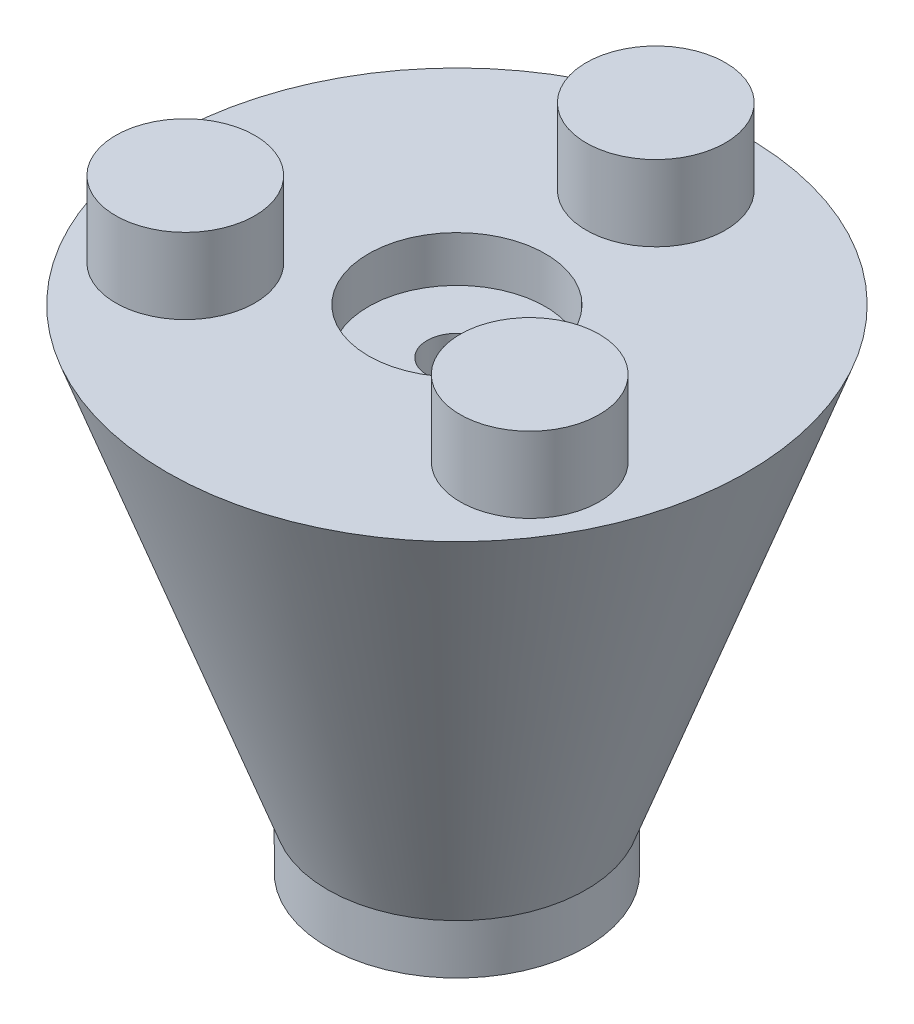
ISO-10303-21;
HEADER;
FILE_DESCRIPTION(('STEP AP214'),'2;1');
FILE_NAME('part.step','',(''),(''),'','','');
FILE_SCHEMA(('AUTOMOTIVE_DESIGN { 1 0 10303 214 1 1 1 1 }'));
ENDSEC;
DATA;
#1=APPLICATION_CONTEXT('core data for automotive mechanical design processes');
#2=APPLICATION_PROTOCOL_DEFINITION('international standard','automotive_design',2000,#1);
#3=PRODUCT_CONTEXT('',#1,'mechanical');
#4=PRODUCT('Part','Part','',(#3));
#5=PRODUCT_RELATED_PRODUCT_CATEGORY('part','',(#4));
#6=PRODUCT_DEFINITION_FORMATION('','',#4);
#7=PRODUCT_DEFINITION_CONTEXT('part definition',#1,'design');
#8=PRODUCT_DEFINITION('design','',#6,#7);
#9=PRODUCT_DEFINITION_SHAPE('','',#8);
#10=(LENGTH_UNIT() NAMED_UNIT(*) SI_UNIT(.MILLI.,.METRE.));
#11=(NAMED_UNIT(*) PLANE_ANGLE_UNIT() SI_UNIT($,.RADIAN.));
#12=(NAMED_UNIT(*) SI_UNIT($,.STERADIAN.) SOLID_ANGLE_UNIT());
#13=UNCERTAINTY_MEASURE_WITH_UNIT(LENGTH_MEASURE(1.E-05),#10,'distance_accuracy_value','');
#14=(GEOMETRIC_REPRESENTATION_CONTEXT(3) GLOBAL_UNCERTAINTY_ASSIGNED_CONTEXT((#13)) GLOBAL_UNIT_ASSIGNED_CONTEXT((#10,
#11,#12)) REPRESENTATION_CONTEXT('',''));
#15=CARTESIAN_POINT('',(0.,0.,0.));
#16=DIRECTION('',(0.,0.,1.));
#17=DIRECTION('',(1.,0.,0.));
#18=AXIS2_PLACEMENT_3D('',#15,#16,#17);
#19=CARTESIAN_POINT('',(0.,-11.8338095116624,0.));
#20=DIRECTION('',(0.,1.,0.));
#21=DIRECTION('',(0.,0.,1.));
#22=AXIS2_PLACEMENT_3D('',#19,#20,#21);
#23=CYLINDRICAL_SURFACE('',#22,3.3);
#24=CARTESIAN_POINT('',(0.,4.925,0.));
#25=DIRECTION('',(0.,-1.,0.));
#26=DIRECTION('',(0.,0.,-1.));
#27=AXIS2_PLACEMENT_3D('',#24,#25,#26);
#28=CIRCLE('',#27,3.3);
#29=CARTESIAN_POINT('',(0.,4.925,-3.3));
#30=VERTEX_POINT('',#29);
#31=EDGE_CURVE('E12',#30,#30,#28,.T.);
#32=ORIENTED_EDGE('',*,*,#31,.T.);
#33=EDGE_LOOP('',(#32));
#34=FACE_BOUND('',#33,.T.);
#35=CARTESIAN_POINT('',(0.,-2.5,0.));
#36=DIRECTION('',(0.,-1.,0.));
#37=DIRECTION('',(0.,0.,-1.));
#38=AXIS2_PLACEMENT_3D('',#35,#36,#37);
#39=CIRCLE('',#38,3.3);
#40=CARTESIAN_POINT('',(0.,-2.5,-3.3));
#41=VERTEX_POINT('',#40);
#42=EDGE_CURVE('E49',#41,#41,#39,.T.);
#43=ORIENTED_EDGE('',*,*,#42,.F.);
#44=EDGE_LOOP('',(#43));
#45=FACE_BOUND('',#44,.T.);
#46=ADVANCED_FACE('F45',(#34,#45),#23,.T.);
#47=CARTESIAN_POINT('',(0.,4.925,0.));
#48=DIRECTION('',(0.,-1.,0.));
#49=DIRECTION('',(0.,0.,-1.));
#50=AXIS2_PLACEMENT_3D('',#47,#48,#49);
#51=PLANE('',#50);
#52=ORIENTED_EDGE('',*,*,#31,.F.);
#53=EDGE_LOOP('',(#52));
#54=FACE_BOUND('',#53,.T.);
#55=CARTESIAN_POINT('',(0.,4.925,0.));
#56=DIRECTION('',(0.,1.,0.));
#57=DIRECTION('',(0.,0.,1.));
#58=AXIS2_PLACEMENT_3D('',#55,#56,#57);
#59=CIRCLE('',#58,1.5);
#60=CARTESIAN_POINT('',(0.,4.925,1.5));
#61=VERTEX_POINT('',#60);
#62=EDGE_CURVE('E58',#61,#61,#59,.T.);
#63=ORIENTED_EDGE('',*,*,#62,.F.);
#64=EDGE_LOOP('',(#63));
#65=FACE_BOUND('',#64,.T.);
#66=ADVANCED_FACE('F86',(#54,#65),#51,.F.);
#67=CARTESIAN_POINT('',(0.,4.925,0.));
#68=DIRECTION('',(0.,-1.,0.));
#69=DIRECTION('',(0.,0.,-1.));
#70=AXIS2_PLACEMENT_3D('',#67,#68,#69);
#71=CONICAL_SURFACE('',#70,1.5,0.237835927457451);
#72=ORIENTED_EDGE('',*,*,#42,.T.);
#73=EDGE_LOOP('',(#72));
#74=FACE_BOUND('',#73,.T.);
#75=ORIENTED_EDGE('',*,*,#62,.T.);
#76=EDGE_LOOP('',(#75));
#77=FACE_BOUND('',#76,.T.);
#78=ADVANCED_FACE('F72',(#74,#77),#71,.F.);
#79=CLOSED_SHELL('',(#46,#66,#78));
#80=MANIFOLD_SOLID_BREP('B2',#79);
#81=CARTESIAN_POINT('',(0.,0.,0.));
#82=DIRECTION('',(0.,1.,0.));
#83=DIRECTION('',(0.,0.,1.));
#84=AXIS2_PLACEMENT_3D('',#81,#82,#83);
#85=CYLINDRICAL_SURFACE('',#84,3.3);
#86=CARTESIAN_POINT('',(0.,-2.5,0.));
#87=DIRECTION('',(0.,-1.,0.));
#88=DIRECTION('',(0.,0.,-1.));
#89=AXIS2_PLACEMENT_3D('',#86,#87,#88);
#90=CIRCLE('',#89,3.300000004);
#91=CARTESIAN_POINT('',(0.,-2.5,-3.300000004));
#92=VERTEX_POINT('',#91);
#93=EDGE_CURVE('E150',#92,#92,#90,.T.);
#94=ORIENTED_EDGE('',*,*,#93,.T.);
#95=EDGE_LOOP('',(#94));
#96=FACE_BOUND('',#95,.T.);
#97=CARTESIAN_POINT('',(0.,4.925,0.));
#98=DIRECTION('',(0.,1.,0.));
#99=DIRECTION('',(0.,0.,1.));
#100=AXIS2_PLACEMENT_3D('',#97,#98,#99);
#101=CIRCLE('',#100,3.3);
#102=CARTESIAN_POINT('',(0.,4.925,3.3));
#103=VERTEX_POINT('',#102);
#104=EDGE_CURVE('E44',#103,#103,#101,.F.);
#105=ORIENTED_EDGE('',*,*,#104,.F.);
#106=EDGE_LOOP('',(#105));
#107=FACE_BOUND('',#106,.T.);
#108=ADVANCED_FACE('F114',(#96,#107),#85,.F.);
#109=CARTESIAN_POINT('',(0.,22.225,0.));
#110=DIRECTION('',(0.,1.,0.));
#111=DIRECTION('',(0.,0.,1.));
#112=AXIS2_PLACEMENT_3D('',#109,#110,#111);
#113=PLANE('',#112);
#114=CARTESIAN_POINT('',(0.,22.225,0.));
#115=DIRECTION('',(0.,1.,0.));
#116=DIRECTION('',(0.,0.,1.));
#117=AXIS2_PLACEMENT_3D('',#114,#115,#116);
#118=CIRCLE('',#117,4.45);
#119=CARTESIAN_POINT('',(0.,22.225,4.45));
#120=VERTEX_POINT('',#119);
#121=EDGE_CURVE('E155',#120,#120,#118,.T.);
#122=ORIENTED_EDGE('',*,*,#121,.F.);
#123=EDGE_LOOP('',(#122));
#124=FACE_BOUND('',#123,.T.);
#125=CARTESIAN_POINT('',(-8.66025403784439,22.225,5.));
#126=DIRECTION('',(0.,1.,0.));
#127=DIRECTION('',(0.,0.,1.));
#128=AXIS2_PLACEMENT_3D('',#125,#126,#127);
#129=CIRCLE('',#128,3.5);
#130=CARTESIAN_POINT('',(-8.66025403784439,22.225,1.5));
#131=VERTEX_POINT('',#130);
#132=EDGE_CURVE('E135',#131,#131,#129,.T.);
#133=ORIENTED_EDGE('',*,*,#132,.F.);
#134=EDGE_LOOP('',(#133));
#135=FACE_BOUND('',#134,.T.);
#136=CARTESIAN_POINT('',(0.,22.225,0.));
#137=DIRECTION('',(0.,1.,0.));
#138=DIRECTION('',(0.,0.,1.));
#139=AXIS2_PLACEMENT_3D('',#136,#137,#138);
#140=CIRCLE('',#139,14.5892384565664);
#141=CARTESIAN_POINT('',(0.,22.225,14.5892384565664));
#142=VERTEX_POINT('',#141);
#143=EDGE_CURVE('E121',#142,#142,#140,.T.);
#144=ORIENTED_EDGE('',*,*,#143,.T.);
#145=EDGE_LOOP('',(#144));
#146=FACE_BOUND('',#145,.T.);
#147=CARTESIAN_POINT('',(0.,22.225,-10.));
#148=DIRECTION('',(0.,1.,0.));
#149=DIRECTION('',(0.,0.,1.));
#150=AXIS2_PLACEMENT_3D('',#147,#148,#149);
#151=CIRCLE('',#150,3.50000000429653);
#152=CARTESIAN_POINT('',(0.,22.225,-13.5000000042965));
#153=VERTEX_POINT('',#152);
#154=EDGE_CURVE('E129',#153,#153,#151,.T.);
#155=ORIENTED_EDGE('',*,*,#154,.F.);
#156=EDGE_LOOP('',(#155));
#157=FACE_BOUND('',#156,.T.);
#158=CARTESIAN_POINT('',(8.66025403784439,22.225,5.));
#159=DIRECTION('',(0.,1.,0.));
#160=DIRECTION('',(0.,0.,1.));
#161=AXIS2_PLACEMENT_3D('',#158,#159,#160);
#162=CIRCLE('',#161,3.5);
#163=CARTESIAN_POINT('',(8.66025403784439,22.225,1.5));
#164=VERTEX_POINT('',#163);
#165=EDGE_CURVE('E141',#164,#164,#162,.T.);
#166=ORIENTED_EDGE('',*,*,#165,.F.);
#167=EDGE_LOOP('',(#166));
#168=FACE_BOUND('',#167,.T.);
#169=ADVANCED_FACE('F189',(#124,#135,#146,#157,#168),#113,.T.);
#170=CARTESIAN_POINT('',(0.,0.,0.));
#171=DIRECTION('',(0.,1.,0.));
#172=DIRECTION('',(0.,0.,1.));
#173=AXIS2_PLACEMENT_3D('',#170,#171,#172);
#174=CONICAL_SURFACE('',#173,6.5,0.349065850398867);
#175=ORIENTED_EDGE('',*,*,#143,.F.);
#176=EDGE_LOOP('',(#175));
#177=FACE_BOUND('',#176,.T.);
#178=CARTESIAN_POINT('',(0.,0.,0.));
#179=DIRECTION('',(0.,-1.,0.));
#180=DIRECTION('',(0.,0.,-1.));
#181=AXIS2_PLACEMENT_3D('',#178,#179,#180);
#182=CIRCLE('',#181,6.5);
#183=CARTESIAN_POINT('',(0.,0.,-6.5));
#184=VERTEX_POINT('',#183);
#185=EDGE_CURVE('E147',#184,#184,#182,.T.);
#186=ORIENTED_EDGE('',*,*,#185,.F.);
#187=EDGE_LOOP('',(#186));
#188=FACE_BOUND('',#187,.T.);
#189=ADVANCED_FACE('F116',(#177,#188),#174,.T.);
#190=CARTESIAN_POINT('',(0.,26.025,-10.));
#191=DIRECTION('',(0.,-1.,0.));
#192=DIRECTION('',(0.,0.,-1.));
#193=AXIS2_PLACEMENT_3D('',#190,#191,#192);
#194=CYLINDRICAL_SURFACE('',#193,3.50000000429653);
#195=CARTESIAN_POINT('',(0.,26.025,-10.));
#196=DIRECTION('',(0.,1.,0.));
#197=DIRECTION('',(0.,0.,1.));
#198=AXIS2_PLACEMENT_3D('',#195,#196,#197);
#199=CIRCLE('',#198,3.50000000429653);
#200=CARTESIAN_POINT('',(0.,26.025,-13.5000000042965));
#201=VERTEX_POINT('',#200);
#202=EDGE_CURVE('E125',#201,#201,#199,.T.);
#203=CARTESIAN_POINT('',(0.,26.025,-13.5000000042965));
#204=CARTESIAN_POINT('',(0.,25.9854166666667,-13.5000000042965));
#205=CARTESIAN_POINT('',(0.,25.9458333333333,-13.5000000042965));
#206=CARTESIAN_POINT('',(0.,25.8666666666667,-13.5000000042965));
#207=CARTESIAN_POINT('',(0.,25.8270833333333,-13.5000000042965));
#208=CARTESIAN_POINT('',(0.,25.7479166666667,-13.5000000042965));
#209=CARTESIAN_POINT('',(0.,25.7083333333333,-13.5000000042965));
#210=CARTESIAN_POINT('',(0.,25.6291666666667,-13.5000000042965));
#211=CARTESIAN_POINT('',(0.,25.5895833333333,-13.5000000042965));
#212=CARTESIAN_POINT('',(0.,25.5104166666667,-13.5000000042965));
#213=CARTESIAN_POINT('',(0.,25.4708333333333,-13.5000000042965));
#214=CARTESIAN_POINT('',(0.,25.3916666666667,-13.5000000042965));
#215=CARTESIAN_POINT('',(0.,25.3520833333333,-13.5000000042965));
#216=CARTESIAN_POINT('',(0.,25.2729166666667,-13.5000000042965));
#217=CARTESIAN_POINT('',(0.,25.2333333333333,-13.5000000042965));
#218=CARTESIAN_POINT('',(0.,25.1541666666667,-13.5000000042965));
#219=CARTESIAN_POINT('',(0.,25.1145833333333,-13.5000000042965));
#220=CARTESIAN_POINT('',(0.,25.0354166666667,-13.5000000042965));
#221=CARTESIAN_POINT('',(0.,24.9958333333333,-13.5000000042965));
#222=CARTESIAN_POINT('',(0.,24.9166666666667,-13.5000000042965));
#223=CARTESIAN_POINT('',(0.,24.8770833333333,-13.5000000042965));
#224=CARTESIAN_POINT('',(0.,24.7979166666667,-13.5000000042965));
#225=CARTESIAN_POINT('',(0.,24.7583333333333,-13.5000000042965));
#226=CARTESIAN_POINT('',(0.,24.6791666666667,-13.5000000042965));
#227=CARTESIAN_POINT('',(0.,24.6395833333333,-13.5000000042965));
#228=CARTESIAN_POINT('',(0.,24.5604166666667,-13.5000000042965));
#229=CARTESIAN_POINT('',(0.,24.5208333333333,-13.5000000042965));
#230=CARTESIAN_POINT('',(0.,24.4416666666667,-13.5000000042965));
#231=CARTESIAN_POINT('',(0.,24.4020833333333,-13.5000000042965));
#232=CARTESIAN_POINT('',(0.,24.3229166666667,-13.5000000042965));
#233=CARTESIAN_POINT('',(0.,24.2833333333333,-13.5000000042965));
#234=CARTESIAN_POINT('',(0.,24.2041666666667,-13.5000000042965));
#235=CARTESIAN_POINT('',(0.,24.1645833333333,-13.5000000042965));
#236=CARTESIAN_POINT('',(0.,24.0854166666667,-13.5000000042965));
#237=CARTESIAN_POINT('',(0.,24.0458333333333,-13.5000000042965));
#238=CARTESIAN_POINT('',(0.,23.9666666666667,-13.5000000042965));
#239=CARTESIAN_POINT('',(0.,23.9270833333333,-13.5000000042965));
#240=CARTESIAN_POINT('',(0.,23.8479166666667,-13.5000000042965));
#241=CARTESIAN_POINT('',(0.,23.8083333333333,-13.5000000042965));
#242=CARTESIAN_POINT('',(0.,23.7291666666667,-13.5000000042965));
#243=CARTESIAN_POINT('',(0.,23.6895833333333,-13.5000000042965));
#244=CARTESIAN_POINT('',(0.,23.6104166666667,-13.5000000042965));
#245=CARTESIAN_POINT('',(0.,23.5708333333333,-13.5000000042965));
#246=CARTESIAN_POINT('',(0.,23.4916666666667,-13.5000000042965));
#247=CARTESIAN_POINT('',(0.,23.4520833333333,-13.5000000042965));
#248=CARTESIAN_POINT('',(0.,23.3729166666667,-13.5000000042965));
#249=CARTESIAN_POINT('',(0.,23.3333333333333,-13.5000000042965));
#250=CARTESIAN_POINT('',(0.,23.2541666666667,-13.5000000042965));
#251=CARTESIAN_POINT('',(0.,23.2145833333333,-13.5000000042965));
#252=CARTESIAN_POINT('',(0.,23.1354166666667,-13.5000000042965));
#253=CARTESIAN_POINT('',(0.,23.0958333333333,-13.5000000042965));
#254=CARTESIAN_POINT('',(0.,23.0166666666667,-13.5000000042965));
#255=CARTESIAN_POINT('',(0.,22.9770833333333,-13.5000000042965));
#256=CARTESIAN_POINT('',(0.,22.8979166666667,-13.5000000042965));
#257=CARTESIAN_POINT('',(0.,22.8583333333333,-13.5000000042965));
#258=CARTESIAN_POINT('',(0.,22.7791666666667,-13.5000000042965));
#259=CARTESIAN_POINT('',(0.,22.7395833333333,-13.5000000042965));
#260=CARTESIAN_POINT('',(0.,22.6604166666667,-13.5000000042965));
#261=CARTESIAN_POINT('',(0.,22.6208333333333,-13.5000000042965));
#262=CARTESIAN_POINT('',(0.,22.5416666666667,-13.5000000042965));
#263=CARTESIAN_POINT('',(0.,22.5020833333333,-13.5000000042965));
#264=CARTESIAN_POINT('',(0.,22.4229166666667,-13.5000000042965));
#265=CARTESIAN_POINT('',(0.,22.3833333333333,-13.5000000042965));
#266=CARTESIAN_POINT('',(0.,22.3041666666667,-13.5000000042965));
#267=CARTESIAN_POINT('',(0.,22.2645833333333,-13.5000000042965));
#268=CARTESIAN_POINT('',(0.,22.225,-13.5000000042965));
#269=B_SPLINE_CURVE_WITH_KNOTS('',3,(#203,#204,#205,#206,#207,#208,#209,#210,#211,#212,#213,
#214,#215,#216,#217,#218,#219,#220,#221,#222,#223,#224,#225,#226,#227,#228,#229,#230,#231,#232,
#233,#234,#235,#236,#237,#238,#239,#240,#241,#242,#243,#244,#245,#246,#247,#248,#249,#250,#251,
#252,#253,#254,#255,#256,#257,#258,#259,#260,#261,#262,#263,#264,#265,#266,#267,#268),
.UNSPECIFIED.,.F.,.F.,(4,2,2,2,2,2,2,2,2,2,2,2,2,2,2,2,2,2,2,2,2,2,2,2,2,2,2,2,2,2,2,2,4),(0.,
0.118750000000001,0.237500000000002,0.356250000000002,0.475000000000003,0.593750000000001,
0.712500000000001,0.831250000000002,0.950000000000003,1.06875,1.1875,1.30625,1.425,1.54375,
1.6625,1.78125,1.9,2.01875,2.1375,2.25625,2.375,2.49375,2.6125,2.73125,2.85,2.96875,3.0875,
3.20625,3.325,3.44375,3.5625,3.68125,3.8),.UNSPECIFIED.);
#270=EDGE_CURVE('BSEAM222',#201,#153,#269,.T.);
#271=ORIENTED_EDGE('',*,*,#202,.F.);
#272=ORIENTED_EDGE('',*,*,#154,.T.);
#273=ORIENTED_EDGE('',*,*,#270,.T.);
#274=ORIENTED_EDGE('',*,*,#270,.F.);
#275=EDGE_LOOP('',(#271,#273,#272,#274));
#276=FACE_BOUND('',#275,.T.);
#277=ADVANCED_FACE('F222',(#276),#194,.T.);
#278=CARTESIAN_POINT('',(0.,26.025,0.));
#279=DIRECTION('',(0.,1.,0.));
#280=DIRECTION('',(0.,0.,1.));
#281=AXIS2_PLACEMENT_3D('',#278,#279,#280);
#282=PLANE('',#281);
#283=ORIENTED_EDGE('',*,*,#202,.T.);
#284=EDGE_LOOP('',(#283));
#285=FACE_BOUND('',#284,.T.);
#286=ADVANCED_FACE('F225',(#285),#282,.T.);
#287=CARTESIAN_POINT('',(-8.66025403784439,26.025,5.));
#288=DIRECTION('',(0.,-1.,0.));
#289=DIRECTION('',(0.,0.,-1.));
#290=AXIS2_PLACEMENT_3D('',#287,#288,#289);
#291=CYLINDRICAL_SURFACE('',#290,3.5);
#292=CARTESIAN_POINT('',(-8.66025403784439,26.025,5.));
#293=DIRECTION('',(0.,1.,0.));
#294=DIRECTION('',(0.,0.,1.));
#295=AXIS2_PLACEMENT_3D('',#292,#293,#294);
#296=CIRCLE('',#295,3.5);
#297=CARTESIAN_POINT('',(-8.66025403784439,26.025,1.5));
#298=VERTEX_POINT('',#297);
#299=EDGE_CURVE('E133',#298,#298,#296,.T.);
#300=CARTESIAN_POINT('',(-8.66025403784439,26.025,1.5));
#301=CARTESIAN_POINT('',(-8.66025403784439,25.9854166666667,1.5));
#302=CARTESIAN_POINT('',(-8.66025403784439,25.9458333333333,1.5));
#303=CARTESIAN_POINT('',(-8.66025403784439,25.8666666666667,1.5));
#304=CARTESIAN_POINT('',(-8.66025403784439,25.8270833333333,1.5));
#305=CARTESIAN_POINT('',(-8.66025403784439,25.7479166666667,1.5));
#306=CARTESIAN_POINT('',(-8.66025403784439,25.7083333333333,1.5));
#307=CARTESIAN_POINT('',(-8.66025403784439,25.6291666666667,1.5));
#308=CARTESIAN_POINT('',(-8.66025403784439,25.5895833333333,1.5));
#309=CARTESIAN_POINT('',(-8.66025403784439,25.5104166666667,1.5));
#310=CARTESIAN_POINT('',(-8.66025403784439,25.4708333333333,1.5));
#311=CARTESIAN_POINT('',(-8.66025403784439,25.3916666666667,1.5));
#312=CARTESIAN_POINT('',(-8.66025403784439,25.3520833333333,1.5));
#313=CARTESIAN_POINT('',(-8.66025403784439,25.2729166666667,1.5));
#314=CARTESIAN_POINT('',(-8.66025403784439,25.2333333333333,1.5));
#315=CARTESIAN_POINT('',(-8.66025403784439,25.1541666666667,1.5));
#316=CARTESIAN_POINT('',(-8.66025403784439,25.1145833333333,1.5));
#317=CARTESIAN_POINT('',(-8.66025403784439,25.0354166666667,1.5));
#318=CARTESIAN_POINT('',(-8.66025403784439,24.9958333333333,1.5));
#319=CARTESIAN_POINT('',(-8.66025403784439,24.9166666666667,1.5));
#320=CARTESIAN_POINT('',(-8.66025403784439,24.8770833333333,1.5));
#321=CARTESIAN_POINT('',(-8.66025403784439,24.7979166666667,1.5));
#322=CARTESIAN_POINT('',(-8.66025403784439,24.7583333333333,1.5));
#323=CARTESIAN_POINT('',(-8.66025403784439,24.6791666666667,1.5));
#324=CARTESIAN_POINT('',(-8.66025403784439,24.6395833333333,1.5));
#325=CARTESIAN_POINT('',(-8.66025403784439,24.5604166666667,1.5));
#326=CARTESIAN_POINT('',(-8.66025403784439,24.5208333333333,1.5));
#327=CARTESIAN_POINT('',(-8.66025403784439,24.4416666666667,1.5));
#328=CARTESIAN_POINT('',(-8.66025403784439,24.4020833333333,1.5));
#329=CARTESIAN_POINT('',(-8.66025403784439,24.3229166666667,1.5));
#330=CARTESIAN_POINT('',(-8.66025403784439,24.2833333333333,1.5));
#331=CARTESIAN_POINT('',(-8.66025403784439,24.2041666666667,1.5));
#332=CARTESIAN_POINT('',(-8.66025403784439,24.1645833333333,1.5));
#333=CARTESIAN_POINT('',(-8.66025403784439,24.0854166666667,1.5));
#334=CARTESIAN_POINT('',(-8.66025403784439,24.0458333333333,1.5));
#335=CARTESIAN_POINT('',(-8.66025403784439,23.9666666666667,1.5));
#336=CARTESIAN_POINT('',(-8.66025403784439,23.9270833333333,1.5));
#337=CARTESIAN_POINT('',(-8.66025403784439,23.8479166666667,1.5));
#338=CARTESIAN_POINT('',(-8.66025403784439,23.8083333333333,1.5));
#339=CARTESIAN_POINT('',(-8.66025403784439,23.7291666666667,1.5));
#340=CARTESIAN_POINT('',(-8.66025403784439,23.6895833333333,1.5));
#341=CARTESIAN_POINT('',(-8.66025403784439,23.6104166666667,1.5));
#342=CARTESIAN_POINT('',(-8.66025403784439,23.5708333333333,1.5));
#343=CARTESIAN_POINT('',(-8.66025403784439,23.4916666666667,1.5));
#344=CARTESIAN_POINT('',(-8.66025403784439,23.4520833333333,1.5));
#345=CARTESIAN_POINT('',(-8.66025403784439,23.3729166666667,1.5));
#346=CARTESIAN_POINT('',(-8.66025403784439,23.3333333333333,1.5));
#347=CARTESIAN_POINT('',(-8.66025403784439,23.2541666666667,1.5));
#348=CARTESIAN_POINT('',(-8.66025403784439,23.2145833333333,1.5));
#349=CARTESIAN_POINT('',(-8.66025403784439,23.1354166666667,1.5));
#350=CARTESIAN_POINT('',(-8.66025403784439,23.0958333333333,1.5));
#351=CARTESIAN_POINT('',(-8.66025403784439,23.0166666666667,1.5));
#352=CARTESIAN_POINT('',(-8.66025403784439,22.9770833333333,1.5));
#353=CARTESIAN_POINT('',(-8.66025403784439,22.8979166666667,1.5));
#354=CARTESIAN_POINT('',(-8.66025403784439,22.8583333333333,1.5));
#355=CARTESIAN_POINT('',(-8.66025403784439,22.7791666666667,1.5));
#356=CARTESIAN_POINT('',(-8.66025403784439,22.7395833333333,1.5));
#357=CARTESIAN_POINT('',(-8.66025403784439,22.6604166666667,1.5));
#358=CARTESIAN_POINT('',(-8.66025403784439,22.6208333333333,1.5));
#359=CARTESIAN_POINT('',(-8.66025403784439,22.5416666666667,1.5));
#360=CARTESIAN_POINT('',(-8.66025403784439,22.5020833333333,1.5));
#361=CARTESIAN_POINT('',(-8.66025403784439,22.4229166666667,1.5));
#362=CARTESIAN_POINT('',(-8.66025403784439,22.3833333333333,1.5));
#363=CARTESIAN_POINT('',(-8.66025403784439,22.3041666666667,1.5));
#364=CARTESIAN_POINT('',(-8.66025403784439,22.2645833333333,1.5));
#365=CARTESIAN_POINT('',(-8.66025403784439,22.225,1.5));
#366=B_SPLINE_CURVE_WITH_KNOTS('',3,(#300,#301,#302,#303,#304,#305,#306,#307,#308,#309,#310,
#311,#312,#313,#314,#315,#316,#317,#318,#319,#320,#321,#322,#323,#324,#325,#326,#327,#328,#329,
#330,#331,#332,#333,#334,#335,#336,#337,#338,#339,#340,#341,#342,#343,#344,#345,#346,#347,#348,
#349,#350,#351,#352,#353,#354,#355,#356,#357,#358,#359,#360,#361,#362,#363,#364,#365),
.UNSPECIFIED.,.F.,.F.,(4,2,2,2,2,2,2,2,2,2,2,2,2,2,2,2,2,2,2,2,2,2,2,2,2,2,2,2,2,2,2,2,4),(0.,
0.118750000000001,0.237500000000002,0.356250000000002,0.475000000000003,0.593750000000001,
0.712500000000001,0.831250000000002,0.950000000000003,1.06875,1.1875,1.30625,1.425,1.54375,
1.6625,1.78125,1.9,2.01875,2.1375,2.25625,2.375,2.49375,2.6125,2.73125,2.85,2.96875,3.0875,
3.20625,3.325,3.44375,3.5625,3.68125,3.8),.UNSPECIFIED.);
#367=EDGE_CURVE('BSEAM211',#298,#131,#366,.T.);
#368=ORIENTED_EDGE('',*,*,#299,.F.);
#369=ORIENTED_EDGE('',*,*,#132,.T.);
#370=ORIENTED_EDGE('',*,*,#367,.T.);
#371=ORIENTED_EDGE('',*,*,#367,.F.);
#372=EDGE_LOOP('',(#368,#370,#369,#371));
#373=FACE_BOUND('',#372,.T.);
#374=ADVANCED_FACE('F211',(#373),#291,.T.);
#375=CARTESIAN_POINT('',(0.,26.025,0.));
#376=DIRECTION('',(0.,1.,0.));
#377=DIRECTION('',(0.,0.,1.));
#378=AXIS2_PLACEMENT_3D('',#375,#376,#377);
#379=PLANE('',#378);
#380=ORIENTED_EDGE('',*,*,#299,.T.);
#381=EDGE_LOOP('',(#380));
#382=FACE_BOUND('',#381,.T.);
#383=ADVANCED_FACE('F201',(#382),#379,.T.);
#384=CARTESIAN_POINT('',(8.66025403784439,26.025,5.));
#385=DIRECTION('',(0.,-1.,0.));
#386=DIRECTION('',(0.,0.,-1.));
#387=AXIS2_PLACEMENT_3D('',#384,#385,#386);
#388=CYLINDRICAL_SURFACE('',#387,3.5);
#389=CARTESIAN_POINT('',(8.66025403784439,26.025,5.));
#390=DIRECTION('',(0.,1.,0.));
#391=DIRECTION('',(0.,0.,1.));
#392=AXIS2_PLACEMENT_3D('',#389,#390,#391);
#393=CIRCLE('',#392,3.5);
#394=CARTESIAN_POINT('',(8.66025403784439,26.025,1.5));
#395=VERTEX_POINT('',#394);
#396=EDGE_CURVE('E138',#395,#395,#393,.T.);
#397=CARTESIAN_POINT('',(8.66025403784439,26.025,1.5));
#398=CARTESIAN_POINT('',(8.66025403784439,25.9854166666667,1.5));
#399=CARTESIAN_POINT('',(8.66025403784439,25.9458333333333,1.5));
#400=CARTESIAN_POINT('',(8.66025403784439,25.8666666666667,1.5));
#401=CARTESIAN_POINT('',(8.66025403784439,25.8270833333333,1.5));
#402=CARTESIAN_POINT('',(8.66025403784439,25.7479166666667,1.5));
#403=CARTESIAN_POINT('',(8.66025403784439,25.7083333333333,1.5));
#404=CARTESIAN_POINT('',(8.66025403784439,25.6291666666667,1.5));
#405=CARTESIAN_POINT('',(8.66025403784439,25.5895833333333,1.5));
#406=CARTESIAN_POINT('',(8.66025403784439,25.5104166666667,1.5));
#407=CARTESIAN_POINT('',(8.66025403784439,25.4708333333333,1.5));
#408=CARTESIAN_POINT('',(8.66025403784439,25.3916666666667,1.5));
#409=CARTESIAN_POINT('',(8.66025403784439,25.3520833333333,1.5));
#410=CARTESIAN_POINT('',(8.66025403784439,25.2729166666667,1.5));
#411=CARTESIAN_POINT('',(8.66025403784439,25.2333333333333,1.5));
#412=CARTESIAN_POINT('',(8.66025403784439,25.1541666666667,1.5));
#413=CARTESIAN_POINT('',(8.66025403784439,25.1145833333333,1.5));
#414=CARTESIAN_POINT('',(8.66025403784439,25.0354166666667,1.5));
#415=CARTESIAN_POINT('',(8.66025403784439,24.9958333333333,1.5));
#416=CARTESIAN_POINT('',(8.66025403784439,24.9166666666667,1.5));
#417=CARTESIAN_POINT('',(8.66025403784439,24.8770833333333,1.5));
#418=CARTESIAN_POINT('',(8.66025403784439,24.7979166666667,1.5));
#419=CARTESIAN_POINT('',(8.66025403784439,24.7583333333333,1.5));
#420=CARTESIAN_POINT('',(8.66025403784439,24.6791666666667,1.5));
#421=CARTESIAN_POINT('',(8.66025403784439,24.6395833333333,1.5));
#422=CARTESIAN_POINT('',(8.66025403784439,24.5604166666667,1.5));
#423=CARTESIAN_POINT('',(8.66025403784439,24.5208333333333,1.5));
#424=CARTESIAN_POINT('',(8.66025403784439,24.4416666666667,1.5));
#425=CARTESIAN_POINT('',(8.66025403784439,24.4020833333333,1.5));
#426=CARTESIAN_POINT('',(8.66025403784439,24.3229166666667,1.5));
#427=CARTESIAN_POINT('',(8.66025403784439,24.2833333333333,1.5));
#428=CARTESIAN_POINT('',(8.66025403784439,24.2041666666667,1.5));
#429=CARTESIAN_POINT('',(8.66025403784439,24.1645833333333,1.5));
#430=CARTESIAN_POINT('',(8.66025403784439,24.0854166666667,1.5));
#431=CARTESIAN_POINT('',(8.66025403784439,24.0458333333333,1.5));
#432=CARTESIAN_POINT('',(8.66025403784439,23.9666666666667,1.5));
#433=CARTESIAN_POINT('',(8.66025403784439,23.9270833333333,1.5));
#434=CARTESIAN_POINT('',(8.66025403784439,23.8479166666667,1.5));
#435=CARTESIAN_POINT('',(8.66025403784439,23.8083333333333,1.5));
#436=CARTESIAN_POINT('',(8.66025403784439,23.7291666666667,1.5));
#437=CARTESIAN_POINT('',(8.66025403784439,23.6895833333333,1.5));
#438=CARTESIAN_POINT('',(8.66025403784439,23.6104166666667,1.5));
#439=CARTESIAN_POINT('',(8.66025403784439,23.5708333333333,1.5));
#440=CARTESIAN_POINT('',(8.66025403784439,23.4916666666667,1.5));
#441=CARTESIAN_POINT('',(8.66025403784439,23.4520833333333,1.5));
#442=CARTESIAN_POINT('',(8.66025403784439,23.3729166666667,1.5));
#443=CARTESIAN_POINT('',(8.66025403784439,23.3333333333333,1.5));
#444=CARTESIAN_POINT('',(8.66025403784439,23.2541666666667,1.5));
#445=CARTESIAN_POINT('',(8.66025403784439,23.2145833333333,1.5));
#446=CARTESIAN_POINT('',(8.66025403784439,23.1354166666667,1.5));
#447=CARTESIAN_POINT('',(8.66025403784439,23.0958333333333,1.5));
#448=CARTESIAN_POINT('',(8.66025403784439,23.0166666666667,1.5));
#449=CARTESIAN_POINT('',(8.66025403784439,22.9770833333333,1.5));
#450=CARTESIAN_POINT('',(8.66025403784439,22.8979166666667,1.5));
#451=CARTESIAN_POINT('',(8.66025403784439,22.8583333333333,1.5));
#452=CARTESIAN_POINT('',(8.66025403784439,22.7791666666667,1.5));
#453=CARTESIAN_POINT('',(8.66025403784439,22.7395833333333,1.5));
#454=CARTESIAN_POINT('',(8.66025403784439,22.6604166666667,1.5));
#455=CARTESIAN_POINT('',(8.66025403784439,22.6208333333333,1.5));
#456=CARTESIAN_POINT('',(8.66025403784439,22.5416666666667,1.5));
#457=CARTESIAN_POINT('',(8.66025403784439,22.5020833333333,1.5));
#458=CARTESIAN_POINT('',(8.66025403784439,22.4229166666667,1.5));
#459=CARTESIAN_POINT('',(8.66025403784439,22.3833333333333,1.5));
#460=CARTESIAN_POINT('',(8.66025403784439,22.3041666666667,1.5));
#461=CARTESIAN_POINT('',(8.66025403784439,22.2645833333333,1.5));
#462=CARTESIAN_POINT('',(8.66025403784439,22.225,1.5));
#463=B_SPLINE_CURVE_WITH_KNOTS('',3,(#397,#398,#399,#400,#401,#402,#403,#404,#405,#406,#407,
#408,#409,#410,#411,#412,#413,#414,#415,#416,#417,#418,#419,#420,#421,#422,#423,#424,#425,#426,
#427,#428,#429,#430,#431,#432,#433,#434,#435,#436,#437,#438,#439,#440,#441,#442,#443,#444,#445,
#446,#447,#448,#449,#450,#451,#452,#453,#454,#455,#456,#457,#458,#459,#460,#461,#462),
.UNSPECIFIED.,.F.,.F.,(4,2,2,2,2,2,2,2,2,2,2,2,2,2,2,2,2,2,2,2,2,2,2,2,2,2,2,2,2,2,2,2,4),(0.,
0.118750000000001,0.237500000000002,0.356250000000002,0.475000000000003,0.593750000000001,
0.712500000000001,0.831250000000002,0.950000000000003,1.06875,1.1875,1.30625,1.425,1.54375,
1.6625,1.78125,1.9,2.01875,2.1375,2.25625,2.375,2.49375,2.6125,2.73125,2.85,2.96875,3.0875,
3.20625,3.325,3.44375,3.5625,3.68125,3.8),.UNSPECIFIED.);
#464=EDGE_CURVE('BSEAM198',#395,#164,#463,.T.);
#465=ORIENTED_EDGE('',*,*,#396,.F.);
#466=ORIENTED_EDGE('',*,*,#165,.T.);
#467=ORIENTED_EDGE('',*,*,#464,.T.);
#468=ORIENTED_EDGE('',*,*,#464,.F.);
#469=EDGE_LOOP('',(#465,#467,#466,#468));
#470=FACE_BOUND('',#469,.T.);
#471=ADVANCED_FACE('F198',(#470),#388,.T.);
#472=CARTESIAN_POINT('',(0.,26.025,0.));
#473=DIRECTION('',(0.,1.,0.));
#474=DIRECTION('',(0.,0.,1.));
#475=AXIS2_PLACEMENT_3D('',#472,#473,#474);
#476=PLANE('',#475);
#477=ORIENTED_EDGE('',*,*,#396,.T.);
#478=EDGE_LOOP('',(#477));
#479=FACE_BOUND('',#478,.T.);
#480=ADVANCED_FACE('F200',(#479),#476,.T.);
#481=CARTESIAN_POINT('',(0.,-2.5,0.));
#482=DIRECTION('',(0.,-1.,0.));
#483=DIRECTION('',(0.,0.,-1.));
#484=AXIS2_PLACEMENT_3D('',#481,#482,#483);
#485=PLANE('',#484);
#486=CARTESIAN_POINT('',(0.,-2.5,0.));
#487=DIRECTION('',(0.,-1.,0.));
#488=DIRECTION('',(0.,0.,-1.));
#489=AXIS2_PLACEMENT_3D('',#486,#487,#488);
#490=CIRCLE('',#489,6.5);
#491=CARTESIAN_POINT('',(0.,-2.5,-6.5));
#492=VERTEX_POINT('',#491);
#493=EDGE_CURVE('E144',#492,#492,#490,.T.);
#494=ORIENTED_EDGE('',*,*,#493,.T.);
#495=EDGE_LOOP('',(#494));
#496=FACE_BOUND('',#495,.T.);
#497=ORIENTED_EDGE('',*,*,#93,.F.);
#498=EDGE_LOOP('',(#497));
#499=FACE_BOUND('',#498,.T.);
#500=ADVANCED_FACE('F208',(#496,#499),#485,.T.);
#501=CARTESIAN_POINT('',(0.,-2.5,0.));
#502=DIRECTION('',(0.,1.,0.));
#503=DIRECTION('',(0.,0.,1.));
#504=AXIS2_PLACEMENT_3D('',#501,#502,#503);
#505=CYLINDRICAL_SURFACE('',#504,6.5);
#506=ORIENTED_EDGE('',*,*,#493,.F.);
#507=EDGE_LOOP('',(#506));
#508=FACE_BOUND('',#507,.T.);
#509=ORIENTED_EDGE('',*,*,#185,.T.);
#510=EDGE_LOOP('',(#509));
#511=FACE_BOUND('',#510,.T.);
#512=ADVANCED_FACE('F185',(#508,#511),#505,.T.);
#513=CARTESIAN_POINT('',(0.,7.225,0.));
#514=DIRECTION('',(0.,1.,0.));
#515=DIRECTION('',(0.,0.,1.));
#516=AXIS2_PLACEMENT_3D('',#513,#514,#515);
#517=CYLINDRICAL_SURFACE('',#516,4.45);
#518=CARTESIAN_POINT('',(0.,19.925,0.));
#519=DIRECTION('',(0.,1.,0.));
#520=DIRECTION('',(0.,0.,1.));
#521=AXIS2_PLACEMENT_3D('',#518,#519,#520);
#522=CIRCLE('',#521,4.45);
#523=CARTESIAN_POINT('',(0.,19.925,4.45));
#524=VERTEX_POINT('',#523);
#525=EDGE_CURVE('E158',#524,#524,#522,.T.);
#526=ORIENTED_EDGE('',*,*,#525,.F.);
#527=EDGE_LOOP('',(#526));
#528=FACE_BOUND('',#527,.T.);
#529=ORIENTED_EDGE('',*,*,#121,.T.);
#530=EDGE_LOOP('',(#529));
#531=FACE_BOUND('',#530,.T.);
#532=ADVANCED_FACE('F182',(#528,#531),#517,.F.);
#533=CARTESIAN_POINT('',(0.,4.925,0.));
#534=DIRECTION('',(0.,1.,0.));
#535=DIRECTION('',(0.,0.,1.));
#536=AXIS2_PLACEMENT_3D('',#533,#534,#535);
#537=PLANE('',#536);
#538=CARTESIAN_POINT('',(0.,4.925,0.));
#539=DIRECTION('',(0.,1.,0.));
#540=DIRECTION('',(0.,0.,1.));
#541=AXIS2_PLACEMENT_3D('',#538,#539,#540);
#542=CIRCLE('',#541,1.5);
#543=CARTESIAN_POINT('',(0.,4.925,1.5));
#544=VERTEX_POINT('',#543);
#545=EDGE_CURVE('E161',#544,#544,#542,.T.);
#546=ORIENTED_EDGE('',*,*,#545,.T.);
#547=EDGE_LOOP('',(#546));
#548=FACE_BOUND('',#547,.T.);
#549=ORIENTED_EDGE('',*,*,#104,.T.);
#550=EDGE_LOOP('',(#549));
#551=FACE_BOUND('',#550,.T.);
#552=ADVANCED_FACE('F168',(#548,#551),#537,.F.);
#553=CARTESIAN_POINT('',(0.,19.925,0.));
#554=DIRECTION('',(0.,1.,0.));
#555=DIRECTION('',(0.,0.,1.));
#556=AXIS2_PLACEMENT_3D('',#553,#554,#555);
#557=PLANE('',#556);
#558=CARTESIAN_POINT('',(0.,19.925,0.));
#559=DIRECTION('',(0.,1.,0.));
#560=DIRECTION('',(0.,0.,1.));
#561=AXIS2_PLACEMENT_3D('',#558,#559,#560);
#562=CIRCLE('',#561,1.5);
#563=CARTESIAN_POINT('',(0.,19.925,1.5));
#564=VERTEX_POINT('',#563);
#565=EDGE_CURVE('E162',#564,#564,#562,.T.);
#566=ORIENTED_EDGE('',*,*,#565,.F.);
#567=EDGE_LOOP('',(#566));
#568=FACE_BOUND('',#567,.T.);
#569=ORIENTED_EDGE('',*,*,#525,.T.);
#570=EDGE_LOOP('',(#569));
#571=FACE_BOUND('',#570,.T.);
#572=ADVANCED_FACE('F173',(#568,#571),#557,.T.);
#573=CARTESIAN_POINT('',(0.,4.925,0.));
#574=DIRECTION('',(0.,1.,0.));
#575=DIRECTION('',(0.,0.,1.));
#576=AXIS2_PLACEMENT_3D('',#573,#574,#575);
#577=CYLINDRICAL_SURFACE('',#576,1.5);
#578=ORIENTED_EDGE('',*,*,#545,.F.);
#579=EDGE_LOOP('',(#578));
#580=FACE_BOUND('',#579,.T.);
#581=ORIENTED_EDGE('',*,*,#565,.T.);
#582=EDGE_LOOP('',(#581));
#583=FACE_BOUND('',#582,.T.);
#584=ADVANCED_FACE('F170',(#580,#583),#577,.F.);
#585=CLOSED_SHELL('',(#108,#169,#189,#277,#286,#374,#383,#471,#480,#500,#512,#532,#552,#572,#584));
#586=MANIFOLD_SOLID_BREP('B7',#585);
#587=ADVANCED_BREP_SHAPE_REPRESENTATION('',(#18,#80,#586),#14);
#588=SHAPE_DEFINITION_REPRESENTATION(#9,#587);
ENDSEC;
END-ISO-10303-21;
